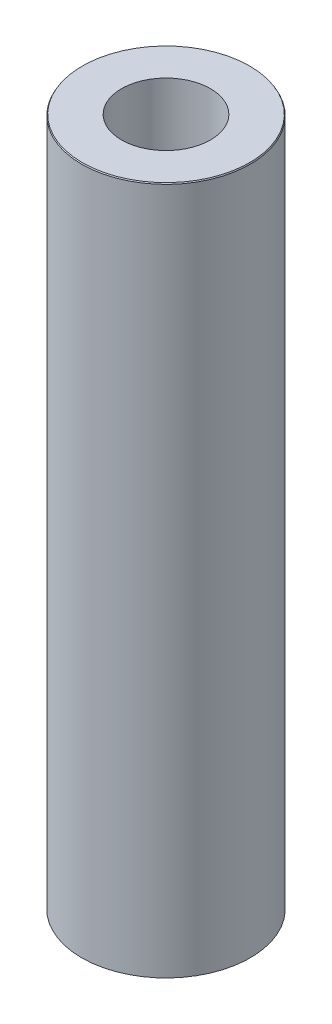
ISO-10303-21;
HEADER;
FILE_DESCRIPTION(('STEP AP214'),'2;1');
FILE_NAME('part.step','',(''),(''),'','','');
FILE_SCHEMA(('AUTOMOTIVE_DESIGN { 1 0 10303 214 1 1 1 1 }'));
ENDSEC;
DATA;
#1=APPLICATION_CONTEXT('core data for automotive mechanical design processes');
#2=APPLICATION_PROTOCOL_DEFINITION('international standard','automotive_design',2000,#1);
#3=PRODUCT_CONTEXT('',#1,'mechanical');
#4=PRODUCT('Part','Part','',(#3));
#5=PRODUCT_RELATED_PRODUCT_CATEGORY('part','',(#4));
#6=PRODUCT_DEFINITION_FORMATION('','',#4);
#7=PRODUCT_DEFINITION_CONTEXT('part definition',#1,'design');
#8=PRODUCT_DEFINITION('design','',#6,#7);
#9=PRODUCT_DEFINITION_SHAPE('','',#8);
#10=(LENGTH_UNIT() NAMED_UNIT(*) SI_UNIT(.MILLI.,.METRE.));
#11=(NAMED_UNIT(*) PLANE_ANGLE_UNIT() SI_UNIT($,.RADIAN.));
#12=(NAMED_UNIT(*) SI_UNIT($,.STERADIAN.) SOLID_ANGLE_UNIT());
#13=UNCERTAINTY_MEASURE_WITH_UNIT(LENGTH_MEASURE(1.E-05),#10,'distance_accuracy_value','');
#14=(GEOMETRIC_REPRESENTATION_CONTEXT(3) GLOBAL_UNCERTAINTY_ASSIGNED_CONTEXT((#13)) GLOBAL_UNIT_ASSIGNED_CONTEXT((#10,
#11,#12)) REPRESENTATION_CONTEXT('',''));
#15=CARTESIAN_POINT('',(0.,0.,0.));
#16=DIRECTION('',(0.,0.,1.));
#17=DIRECTION('',(1.,0.,0.));
#18=AXIS2_PLACEMENT_3D('',#15,#16,#17);
#19=CARTESIAN_POINT('',(0.,326.847605287403,0.));
#20=DIRECTION('',(0.,-1.,0.));
#21=DIRECTION('',(0.,0.,-1.));
#22=AXIS2_PLACEMENT_3D('',#19,#20,#21);
#23=CYLINDRICAL_SURFACE('',#22,40.);
#24=CARTESIAN_POINT('',(0.,326.330731764136,0.));
#25=DIRECTION('',(0.,1.,0.));
#26=DIRECTION('',(0.,0.,1.));
#27=AXIS2_PLACEMENT_3D('',#24,#25,#26);
#28=CIRCLE('',#27,40.);
#29=CARTESIAN_POINT('',(0.,326.330731764136,40.));
#30=VERTEX_POINT('',#29);
#31=EDGE_CURVE('E50',#30,#30,#28,.F.);
#32=ORIENTED_EDGE('',*,*,#31,.T.);
#33=EDGE_LOOP('',(#32));
#34=FACE_BOUND('',#33,.T.);
#35=CARTESIAN_POINT('',(0.,0.298417067795154,0.));
#36=DIRECTION('',(0.,1.,0.));
#37=DIRECTION('',(0.,0.,1.));
#38=AXIS2_PLACEMENT_3D('',#35,#36,#37);
#39=CIRCLE('',#38,40.);
#40=CARTESIAN_POINT('',(0.,0.298417067795154,40.));
#41=VERTEX_POINT('',#40);
#42=EDGE_CURVE('E51',#41,#41,#39,.T.);
#43=ORIENTED_EDGE('',*,*,#42,.T.);
#44=EDGE_LOOP('',(#43));
#45=FACE_BOUND('',#44,.T.);
#46=ADVANCED_FACE('F39',(#34,#45),#23,.T.);
#47=CARTESIAN_POINT('',(0.,326.847605287403,0.));
#48=DIRECTION('',(0.,1.,0.));
#49=DIRECTION('',(0.,0.,1.));
#50=AXIS2_PLACEMENT_3D('',#47,#48,#49);
#51=PLANE('',#50);
#52=CARTESIAN_POINT('',(0.,326.847605287403,0.));
#53=DIRECTION('',(0.,1.,0.));
#54=DIRECTION('',(0.,0.,1.));
#55=AXIS2_PLACEMENT_3D('',#52,#53,#54);
#56=CIRCLE('',#55,39.7015829322049);
#57=CARTESIAN_POINT('',(0.,326.847605287403,39.7015829322049));
#58=VERTEX_POINT('',#57);
#59=EDGE_CURVE('E54',#58,#58,#56,.T.);
#60=ORIENTED_EDGE('',*,*,#59,.T.);
#61=EDGE_LOOP('',(#60));
#62=FACE_BOUND('',#61,.T.);
#63=CARTESIAN_POINT('',(0.,326.847605287403,0.));
#64=DIRECTION('',(0.,1.,0.));
#65=DIRECTION('',(0.,0.,1.));
#66=AXIS2_PLACEMENT_3D('',#63,#64,#65);
#67=CIRCLE('',#66,21.094543599262);
#68=CARTESIAN_POINT('',(0.,326.847605287403,21.094543599262));
#69=VERTEX_POINT('',#68);
#70=EDGE_CURVE('E58',#69,#69,#67,.T.);
#71=ORIENTED_EDGE('',*,*,#70,.F.);
#72=EDGE_LOOP('',(#71));
#73=FACE_BOUND('',#72,.T.);
#74=ADVANCED_FACE('F69',(#62,#73),#51,.T.);
#75=CARTESIAN_POINT('',(0.,0.,0.));
#76=DIRECTION('',(0.,1.,0.));
#77=DIRECTION('',(0.,0.,1.));
#78=AXIS2_PLACEMENT_3D('',#75,#76,#77);
#79=PLANE('',#78);
#80=CARTESIAN_POINT('',(0.,0.,0.));
#81=DIRECTION('',(0.,1.,0.));
#82=DIRECTION('',(0.,0.,1.));
#83=AXIS2_PLACEMENT_3D('',#80,#81,#82);
#84=CIRCLE('',#83,39.4831264767331);
#85=CARTESIAN_POINT('',(0.,0.,39.4831264767331));
#86=VERTEX_POINT('',#85);
#87=EDGE_CURVE('E10',#86,#86,#84,.F.);
#88=ORIENTED_EDGE('',*,*,#87,.T.);
#89=EDGE_LOOP('',(#88));
#90=FACE_BOUND('',#89,.T.);
#91=CARTESIAN_POINT('',(0.,0.,0.));
#92=DIRECTION('',(0.,1.,0.));
#93=DIRECTION('',(0.,0.,1.));
#94=AXIS2_PLACEMENT_3D('',#91,#92,#93);
#95=CIRCLE('',#94,21.094543599262);
#96=CARTESIAN_POINT('',(0.,0.,21.094543599262));
#97=VERTEX_POINT('',#96);
#98=EDGE_CURVE('E63',#97,#97,#95,.T.);
#99=ORIENTED_EDGE('',*,*,#98,.T.);
#100=EDGE_LOOP('',(#99));
#101=FACE_BOUND('',#100,.T.);
#102=ADVANCED_FACE('F75',(#90,#101),#79,.F.);
#103=CARTESIAN_POINT('',(0.,326.847605287403,0.));
#104=DIRECTION('',(0.,-1.,0.));
#105=DIRECTION('',(0.,0.,-1.));
#106=AXIS2_PLACEMENT_3D('',#103,#104,#105);
#107=CYLINDRICAL_SURFACE('',#106,21.094543599262);
#108=ORIENTED_EDGE('',*,*,#70,.T.);
#109=EDGE_LOOP('',(#108));
#110=FACE_BOUND('',#109,.T.);
#111=ORIENTED_EDGE('',*,*,#98,.F.);
#112=EDGE_LOOP('',(#111));
#113=FACE_BOUND('',#112,.T.);
#114=ADVANCED_FACE('F70',(#110,#113),#107,.F.);
#115=CARTESIAN_POINT('',(0.,326.847605287403,0.));
#116=DIRECTION('',(0.,-1.,0.));
#117=DIRECTION('',(0.,0.,-1.));
#118=AXIS2_PLACEMENT_3D('',#115,#116,#117);
#119=CONICAL_SURFACE('',#118,39.7015829322049,0.523598775598279);
#120=ORIENTED_EDGE('',*,*,#31,.F.);
#121=EDGE_LOOP('',(#120));
#122=FACE_BOUND('',#121,.T.);
#123=ORIENTED_EDGE('',*,*,#59,.F.);
#124=EDGE_LOOP('',(#123));
#125=FACE_BOUND('',#124,.T.);
#126=ADVANCED_FACE('F81',(#122,#125),#119,.T.);
#127=CARTESIAN_POINT('',(0.,0.298417067795154,0.));
#128=DIRECTION('',(0.,1.,0.));
#129=DIRECTION('',(0.,0.,1.));
#130=AXIS2_PLACEMENT_3D('',#127,#128,#129);
#131=CONICAL_SURFACE('',#130,40.,1.04719755119659);
#132=ORIENTED_EDGE('',*,*,#87,.F.);
#133=EDGE_LOOP('',(#132));
#134=FACE_BOUND('',#133,.T.);
#135=ORIENTED_EDGE('',*,*,#42,.F.);
#136=EDGE_LOOP('',(#135));
#137=FACE_BOUND('',#136,.T.);
#138=ADVANCED_FACE('F45',(#134,#137),#131,.T.);
#139=CLOSED_SHELL('',(#46,#74,#102,#114,#126,#138));
#140=MANIFOLD_SOLID_BREP('B2',#139);
#141=ADVANCED_BREP_SHAPE_REPRESENTATION('',(#18,#140),#14);
#142=SHAPE_DEFINITION_REPRESENTATION(#9,#141);
ENDSEC;
END-ISO-10303-21;
